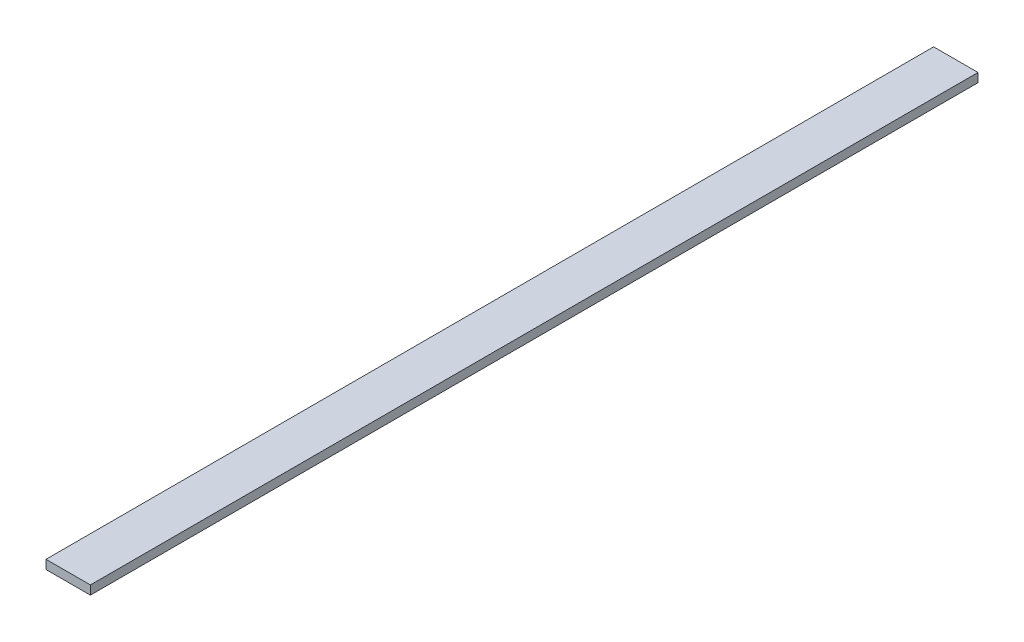
ISO-10303-21;
HEADER;
FILE_DESCRIPTION(('STEP AP214'),'2;1');
FILE_NAME('part.step','',(''),(''),'','','');
FILE_SCHEMA(('AUTOMOTIVE_DESIGN { 1 0 10303 214 1 1 1 1 }'));
ENDSEC;
DATA;
#1=APPLICATION_CONTEXT('core data for automotive mechanical design processes');
#2=APPLICATION_PROTOCOL_DEFINITION('international standard','automotive_design',2000,#1);
#3=PRODUCT_CONTEXT('',#1,'mechanical');
#4=PRODUCT('Part','Part','',(#3));
#5=PRODUCT_RELATED_PRODUCT_CATEGORY('part','',(#4));
#6=PRODUCT_DEFINITION_FORMATION('','',#4);
#7=PRODUCT_DEFINITION_CONTEXT('part definition',#1,'design');
#8=PRODUCT_DEFINITION('design','',#6,#7);
#9=PRODUCT_DEFINITION_SHAPE('','',#8);
#10=(LENGTH_UNIT() NAMED_UNIT(*) SI_UNIT(.MILLI.,.METRE.));
#11=(NAMED_UNIT(*) PLANE_ANGLE_UNIT() SI_UNIT($,.RADIAN.));
#12=(NAMED_UNIT(*) SI_UNIT($,.STERADIAN.) SOLID_ANGLE_UNIT());
#13=UNCERTAINTY_MEASURE_WITH_UNIT(LENGTH_MEASURE(1.E-05),#10,'distance_accuracy_value','');
#14=(GEOMETRIC_REPRESENTATION_CONTEXT(3) GLOBAL_UNCERTAINTY_ASSIGNED_CONTEXT((#13)) GLOBAL_UNIT_ASSIGNED_CONTEXT((#10,
#11,#12)) REPRESENTATION_CONTEXT('',''));
#15=CARTESIAN_POINT('',(0.,0.,0.));
#16=DIRECTION('',(0.,0.,1.));
#17=DIRECTION('',(1.,0.,0.));
#18=AXIS2_PLACEMENT_3D('',#15,#16,#17);
#19=CARTESIAN_POINT('',(50.,-10.,2000.));
#20=DIRECTION('',(-1.,0.,0.));
#21=DIRECTION('',(0.,0.,1.));
#22=AXIS2_PLACEMENT_3D('',#19,#20,#21);
#23=PLANE('',#22);
#24=DIRECTION('',(0.,1.,0.));
#25=VECTOR('',#24,1.);
#26=CARTESIAN_POINT('',(50.,-10.,0.));
#27=LINE('',#26,#25);
#28=CARTESIAN_POINT('',(50.,-10.,0.));
#29=VERTEX_POINT('',#28);
#30=CARTESIAN_POINT('',(50.,10.,0.));
#31=VERTEX_POINT('',#30);
#32=EDGE_CURVE('E107',#29,#31,#27,.T.);
#33=ORIENTED_EDGE('',*,*,#32,.T.);
#34=DIRECTION('',(0.,0.,-1.));
#35=VECTOR('',#34,1.);
#36=CARTESIAN_POINT('',(50.,10.,2000.));
#37=LINE('',#36,#35);
#38=CARTESIAN_POINT('',(50.,10.,2000.));
#39=VERTEX_POINT('',#38);
#40=EDGE_CURVE('E11',#39,#31,#37,.T.);
#41=ORIENTED_EDGE('',*,*,#40,.F.);
#42=DIRECTION('',(0.,1.,0.));
#43=VECTOR('',#42,1.);
#44=CARTESIAN_POINT('',(50.,-10.,2000.));
#45=LINE('',#44,#43);
#46=CARTESIAN_POINT('',(50.,-10.,2000.));
#47=VERTEX_POINT('',#46);
#48=EDGE_CURVE('E91',#47,#39,#45,.T.);
#49=ORIENTED_EDGE('',*,*,#48,.F.);
#50=DIRECTION('',(0.,0.,-1.));
#51=VECTOR('',#50,1.);
#52=CARTESIAN_POINT('',(50.,-10.,2000.));
#53=LINE('',#52,#51);
#54=EDGE_CURVE('E103',#47,#29,#53,.T.);
#55=ORIENTED_EDGE('',*,*,#54,.T.);
#56=EDGE_LOOP('',(#33,#41,#49,#55));
#57=FACE_BOUND('',#56,.T.);
#58=ADVANCED_FACE('F39',(#57),#23,.F.);
#59=CARTESIAN_POINT('',(-50.,10.,2000.));
#60=DIRECTION('',(0.,-1.,0.));
#61=DIRECTION('',(0.,0.,-1.));
#62=AXIS2_PLACEMENT_3D('',#59,#60,#61);
#63=PLANE('',#62);
#64=DIRECTION('',(-1.,0.,0.));
#65=VECTOR('',#64,1.);
#66=CARTESIAN_POINT('',(-50.,10.,0.));
#67=LINE('',#66,#65);
#68=CARTESIAN_POINT('',(-50.,10.,0.));
#69=VERTEX_POINT('',#68);
#70=EDGE_CURVE('E96',#31,#69,#67,.T.);
#71=ORIENTED_EDGE('',*,*,#70,.T.);
#72=DIRECTION('',(0.,0.,-1.));
#73=VECTOR('',#72,1.);
#74=CARTESIAN_POINT('',(-50.,10.,2000.));
#75=LINE('',#74,#73);
#76=CARTESIAN_POINT('',(-50.,10.,2000.));
#77=VERTEX_POINT('',#76);
#78=EDGE_CURVE('E48',#77,#69,#75,.T.);
#79=ORIENTED_EDGE('',*,*,#78,.F.);
#80=DIRECTION('',(-1.,0.,0.));
#81=VECTOR('',#80,1.);
#82=CARTESIAN_POINT('',(-50.,10.,2000.));
#83=LINE('',#82,#81);
#84=EDGE_CURVE('E86',#39,#77,#83,.T.);
#85=ORIENTED_EDGE('',*,*,#84,.F.);
#86=ORIENTED_EDGE('',*,*,#40,.T.);
#87=EDGE_LOOP('',(#71,#79,#85,#86));
#88=FACE_BOUND('',#87,.T.);
#89=ADVANCED_FACE('F95',(#88),#63,.F.);
#90=CARTESIAN_POINT('',(-50.,-10.,2000.));
#91=DIRECTION('',(1.,0.,0.));
#92=DIRECTION('',(0.,0.,-1.));
#93=AXIS2_PLACEMENT_3D('',#90,#91,#92);
#94=PLANE('',#93);
#95=DIRECTION('',(0.,-1.,0.));
#96=VECTOR('',#95,1.);
#97=CARTESIAN_POINT('',(-50.,-10.,0.));
#98=LINE('',#97,#96);
#99=CARTESIAN_POINT('',(-50.,-10.,0.));
#100=VERTEX_POINT('',#99);
#101=EDGE_CURVE('E73',#69,#100,#98,.T.);
#102=ORIENTED_EDGE('',*,*,#101,.T.);
#103=DIRECTION('',(0.,0.,-1.));
#104=VECTOR('',#103,1.);
#105=CARTESIAN_POINT('',(-50.,-10.,2000.));
#106=LINE('',#105,#104);
#107=CARTESIAN_POINT('',(-50.,-10.,2000.));
#108=VERTEX_POINT('',#107);
#109=EDGE_CURVE('E98',#108,#100,#106,.T.);
#110=ORIENTED_EDGE('',*,*,#109,.F.);
#111=DIRECTION('',(0.,-1.,0.));
#112=VECTOR('',#111,1.);
#113=CARTESIAN_POINT('',(-50.,-10.,2000.));
#114=LINE('',#113,#112);
#115=EDGE_CURVE('E89',#77,#108,#114,.T.);
#116=ORIENTED_EDGE('',*,*,#115,.F.);
#117=ORIENTED_EDGE('',*,*,#78,.T.);
#118=EDGE_LOOP('',(#102,#110,#116,#117));
#119=FACE_BOUND('',#118,.T.);
#120=ADVANCED_FACE('F99',(#119),#94,.F.);
#121=CARTESIAN_POINT('',(-50.,-10.,2000.));
#122=DIRECTION('',(0.,1.,0.));
#123=DIRECTION('',(0.,0.,1.));
#124=AXIS2_PLACEMENT_3D('',#121,#122,#123);
#125=PLANE('',#124);
#126=DIRECTION('',(1.,0.,0.));
#127=VECTOR('',#126,1.);
#128=CARTESIAN_POINT('',(-50.,-10.,0.));
#129=LINE('',#128,#127);
#130=EDGE_CURVE('E79',#100,#29,#129,.T.);
#131=ORIENTED_EDGE('',*,*,#130,.T.);
#132=ORIENTED_EDGE('',*,*,#54,.F.);
#133=DIRECTION('',(1.,0.,0.));
#134=VECTOR('',#133,1.);
#135=CARTESIAN_POINT('',(-50.,-10.,2000.));
#136=LINE('',#135,#134);
#137=EDGE_CURVE('E56',#108,#47,#136,.T.);
#138=ORIENTED_EDGE('',*,*,#137,.F.);
#139=ORIENTED_EDGE('',*,*,#109,.T.);
#140=EDGE_LOOP('',(#131,#132,#138,#139));
#141=FACE_BOUND('',#140,.T.);
#142=ADVANCED_FACE('F120',(#141),#125,.F.);
#143=CARTESIAN_POINT('',(0.,0.,2000.));
#144=DIRECTION('',(0.,0.,-1.));
#145=DIRECTION('',(-1.,0.,0.));
#146=AXIS2_PLACEMENT_3D('',#143,#144,#145);
#147=PLANE('',#146);
#148=ORIENTED_EDGE('',*,*,#48,.T.);
#149=ORIENTED_EDGE('',*,*,#84,.T.);
#150=ORIENTED_EDGE('',*,*,#115,.T.);
#151=ORIENTED_EDGE('',*,*,#137,.T.);
#152=EDGE_LOOP('',(#148,#149,#150,#151));
#153=FACE_BOUND('',#152,.T.);
#154=ADVANCED_FACE('F87',(#153),#147,.F.);
#155=CARTESIAN_POINT('',(0.,0.,0.));
#156=DIRECTION('',(0.,0.,-1.));
#157=DIRECTION('',(-1.,0.,0.));
#158=AXIS2_PLACEMENT_3D('',#155,#156,#157);
#159=PLANE('',#158);
#160=ORIENTED_EDGE('',*,*,#32,.F.);
#161=ORIENTED_EDGE('',*,*,#130,.F.);
#162=ORIENTED_EDGE('',*,*,#101,.F.);
#163=ORIENTED_EDGE('',*,*,#70,.F.);
#164=EDGE_LOOP('',(#160,#161,#162,#163));
#165=FACE_BOUND('',#164,.T.);
#166=ADVANCED_FACE('F123',(#165),#159,.T.);
#167=CLOSED_SHELL('',(#58,#89,#120,#142,#154,#166));
#168=MANIFOLD_SOLID_BREP('B2',#167);
#169=ADVANCED_BREP_SHAPE_REPRESENTATION('',(#18,#168),#14);
#170=SHAPE_DEFINITION_REPRESENTATION(#9,#169);
ENDSEC;
END-ISO-10303-21;
